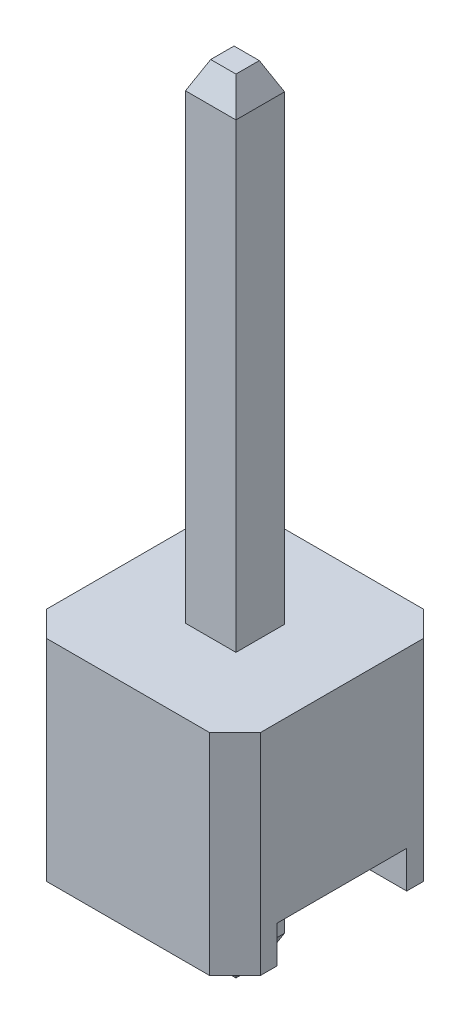
ISO-10303-21;
HEADER;
FILE_DESCRIPTION(('STEP AP214'),'2;1');
FILE_NAME('part.step','',(''),(''),'','','');
FILE_SCHEMA(('AUTOMOTIVE_DESIGN { 1 0 10303 214 1 1 1 1 }'));
ENDSEC;
DATA;
#1=APPLICATION_CONTEXT('core data for automotive mechanical design processes');
#2=APPLICATION_PROTOCOL_DEFINITION('international standard','automotive_design',2000,#1);
#3=PRODUCT_CONTEXT('',#1,'mechanical');
#4=PRODUCT('Part','Part','',(#3));
#5=PRODUCT_RELATED_PRODUCT_CATEGORY('part','',(#4));
#6=PRODUCT_DEFINITION_FORMATION('','',#4);
#7=PRODUCT_DEFINITION_CONTEXT('part definition',#1,'design');
#8=PRODUCT_DEFINITION('design','',#6,#7);
#9=PRODUCT_DEFINITION_SHAPE('','',#8);
#10=(LENGTH_UNIT() NAMED_UNIT(*) SI_UNIT(.MILLI.,.METRE.));
#11=(NAMED_UNIT(*) PLANE_ANGLE_UNIT() SI_UNIT($,.RADIAN.));
#12=(NAMED_UNIT(*) SI_UNIT($,.STERADIAN.) SOLID_ANGLE_UNIT());
#13=UNCERTAINTY_MEASURE_WITH_UNIT(LENGTH_MEASURE(1.E-05),#10,'distance_accuracy_value','');
#14=(GEOMETRIC_REPRESENTATION_CONTEXT(3) GLOBAL_UNCERTAINTY_ASSIGNED_CONTEXT((#13)) GLOBAL_UNIT_ASSIGNED_CONTEXT((#10,
#11,#12)) REPRESENTATION_CONTEXT('',''));
#15=CARTESIAN_POINT('',(0.,0.,0.));
#16=DIRECTION('',(0.,0.,1.));
#17=DIRECTION('',(1.,0.,0.));
#18=AXIS2_PLACEMENT_3D('',#15,#16,#17);
#19=CARTESIAN_POINT('',(15.6674969604626,-5.69124998633488,2.27287404611807));
#20=DIRECTION('',(0.,-1.,0.));
#21=DIRECTION('',(0.,0.,-1.));
#22=AXIS2_PLACEMENT_3D('',#19,#20,#21);
#23=PLANE('',#22);
#24=DIRECTION('',(1.,0.,0.));
#25=VECTOR('',#24,1.);
#26=CARTESIAN_POINT('',(15.0674969604626,-5.69124998633488,2.42287404611807));
#27=LINE('',#26,#25);
#28=CARTESIAN_POINT('',(15.2174969604626,-5.69124998633488,2.42287404611807));
#29=VERTEX_POINT('',#28);
#30=CARTESIAN_POINT('',(15.5174969604626,-5.69124998633488,2.42287404611807));
#31=VERTEX_POINT('',#30);
#32=EDGE_CURVE('E194',#29,#31,#27,.T.);
#33=ORIENTED_EDGE('',*,*,#32,.T.);
#34=DIRECTION('',(0.,0.,1.));
#35=VECTOR('',#34,1.);
#36=CARTESIAN_POINT('',(15.5174969604626,-5.69124998633488,2.27287404611807));
#37=LINE('',#36,#35);
#38=CARTESIAN_POINT('',(15.5174969604626,-5.69124998633488,2.70038017622598));
#39=VERTEX_POINT('',#38);
#40=EDGE_CURVE('E179',#31,#39,#37,.T.);
#41=ORIENTED_EDGE('',*,*,#40,.T.);
#42=DIRECTION('',(1.,0.,0.));
#43=VECTOR('',#42,1.);
#44=CARTESIAN_POINT('',(15.6674969604626,-5.69124998633488,2.70038017622598));
#45=LINE('',#44,#43);
#46=CARTESIAN_POINT('',(15.2174969604626,-5.69124998633488,2.70038017622598));
#47=VERTEX_POINT('',#46);
#48=EDGE_CURVE('E20',#39,#47,#45,.F.);
#49=ORIENTED_EDGE('',*,*,#48,.T.);
#50=DIRECTION('',(0.,0.,1.));
#51=VECTOR('',#50,1.);
#52=CARTESIAN_POINT('',(15.2174969604626,-5.69124998633488,2.85038017622598));
#53=LINE('',#52,#51);
#54=EDGE_CURVE('E174',#47,#29,#53,.F.);
#55=ORIENTED_EDGE('',*,*,#54,.T.);
#56=EDGE_LOOP('',(#33,#41,#49,#55));
#57=FACE_BOUND('',#56,.T.);
#58=ADVANCED_FACE('F17',(#57),#23,.T.);
#59=CARTESIAN_POINT('',(15.6674969604626,-5.36957394825845,2.85038017622598));
#60=DIRECTION('',(0.,0.4226182617407,-0.90630778703665));
#61=DIRECTION('',(0.,0.90630778703665,0.4226182617407));
#62=AXIS2_PLACEMENT_3D('',#59,#60,#61);
#63=PLANE('',#62);
#64=DIRECTION('',(1.,0.,0.));
#65=VECTOR('',#64,1.);
#66=CARTESIAN_POINT('',(15.6674969604626,-5.36957394825845,2.85038017622598));
#67=LINE('',#66,#65);
#68=CARTESIAN_POINT('',(15.0674969604626,-5.36957394825845,2.85038017622598));
#69=VERTEX_POINT('',#68);
#70=CARTESIAN_POINT('',(15.6674969604626,-5.36957394825845,2.85038017622598));
#71=VERTEX_POINT('',#70);
#72=EDGE_CURVE('E186',#69,#71,#67,.T.);
#73=ORIENTED_EDGE('',*,*,#72,.F.);
#74=DIRECTION('',(0.389281620635028,-0.834817129478987,-0.389281620635024));
#75=VECTOR('',#74,1.);
#76=CARTESIAN_POINT('',(15.0674969604626,-5.36957394825845,2.85038017622598));
#77=LINE('',#76,#75);
#78=EDGE_CURVE('E182',#69,#47,#77,.T.);
#79=ORIENTED_EDGE('',*,*,#78,.T.);
#80=ORIENTED_EDGE('',*,*,#48,.F.);
#81=DIRECTION('',(0.389281620635027,0.834817129478987,0.389281620635025));
#82=VECTOR('',#81,1.);
#83=CARTESIAN_POINT('',(15.5174969604626,-5.69124998633488,2.70038017622598));
#84=LINE('',#83,#82);
#85=EDGE_CURVE('E202',#39,#71,#84,.T.);
#86=ORIENTED_EDGE('',*,*,#85,.T.);
#87=EDGE_LOOP('',(#73,#79,#80,#86));
#88=FACE_BOUND('',#87,.T.);
#89=ADVANCED_FACE('F184',(#88),#63,.F.);
#90=CARTESIAN_POINT('',(15.0674969604626,-5.36957394825845,2.85038017622598));
#91=DIRECTION('',(0.906307787036649,0.422618261740701,0.));
#92=DIRECTION('',(-0.422618261740701,0.906307787036649,0.));
#93=AXIS2_PLACEMENT_3D('',#90,#91,#92);
#94=PLANE('',#93);
#95=ORIENTED_EDGE('',*,*,#54,.F.);
#96=ORIENTED_EDGE('',*,*,#78,.F.);
#97=DIRECTION('',(0.,0.,1.));
#98=VECTOR('',#97,1.);
#99=CARTESIAN_POINT('',(15.0674969604626,-5.36957394825845,2.85038017622598));
#100=LINE('',#99,#98);
#101=CARTESIAN_POINT('',(15.0674969604626,-5.36957394825845,2.27287404611807));
#102=VERTEX_POINT('',#101);
#103=EDGE_CURVE('E205',#102,#69,#100,.T.);
#104=ORIENTED_EDGE('',*,*,#103,.F.);
#105=DIRECTION('',(0.389281620635023,-0.834817129478988,0.389281620635027));
#106=VECTOR('',#105,1.);
#107=CARTESIAN_POINT('',(15.0674969604626,-5.36957394825845,2.27287404611807));
#108=LINE('',#107,#106);
#109=EDGE_CURVE('E191',#102,#29,#108,.T.);
#110=ORIENTED_EDGE('',*,*,#109,.T.);
#111=EDGE_LOOP('',(#95,#96,#104,#110));
#112=FACE_BOUND('',#111,.T.);
#113=ADVANCED_FACE('F189',(#112),#94,.F.);
#114=CARTESIAN_POINT('',(15.0674969604626,-5.36957394825845,2.27287404611807));
#115=DIRECTION('',(0.,0.422618261740701,0.906307787036649));
#116=DIRECTION('',(0.,-0.906307787036649,0.422618261740701));
#117=AXIS2_PLACEMENT_3D('',#114,#115,#116);
#118=PLANE('',#117);
#119=ORIENTED_EDGE('',*,*,#32,.F.);
#120=ORIENTED_EDGE('',*,*,#109,.F.);
#121=DIRECTION('',(-1.,0.,0.));
#122=VECTOR('',#121,1.);
#123=CARTESIAN_POINT('',(15.0674969604626,-5.36957394825845,2.27287404611807));
#124=LINE('',#123,#122);
#125=CARTESIAN_POINT('',(15.6674969604626,-5.36957394825845,2.27287404611807));
#126=VERTEX_POINT('',#125);
#127=EDGE_CURVE('E211',#126,#102,#124,.T.);
#128=ORIENTED_EDGE('',*,*,#127,.F.);
#129=DIRECTION('',(-0.389281620635028,-0.834817129478988,0.389281620635023));
#130=VECTOR('',#129,1.);
#131=CARTESIAN_POINT('',(15.6674969604626,-5.36957394825845,2.27287404611807));
#132=LINE('',#131,#130);
#133=EDGE_CURVE('E198',#126,#31,#132,.T.);
#134=ORIENTED_EDGE('',*,*,#133,.T.);
#135=EDGE_LOOP('',(#119,#120,#128,#134));
#136=FACE_BOUND('',#135,.T.);
#137=ADVANCED_FACE('F518',(#136),#118,.F.);
#138=CARTESIAN_POINT('',(15.6674969604626,-5.36957394825845,2.27287404611807));
#139=DIRECTION('',(-0.906307787036649,0.422618261740701,0.));
#140=DIRECTION('',(-0.422618261740701,-0.906307787036649,0.));
#141=AXIS2_PLACEMENT_3D('',#138,#139,#140);
#142=PLANE('',#141);
#143=ORIENTED_EDGE('',*,*,#40,.F.);
#144=ORIENTED_EDGE('',*,*,#133,.F.);
#145=DIRECTION('',(0.,0.,-1.));
#146=VECTOR('',#145,1.);
#147=CARTESIAN_POINT('',(15.6674969604626,-5.36957394825845,2.27287404611807));
#148=LINE('',#147,#146);
#149=EDGE_CURVE('E220',#71,#126,#148,.T.);
#150=ORIENTED_EDGE('',*,*,#149,.F.);
#151=ORIENTED_EDGE('',*,*,#85,.F.);
#152=EDGE_LOOP('',(#143,#144,#150,#151));
#153=FACE_BOUND('',#152,.T.);
#154=ADVANCED_FACE('F514',(#153),#142,.F.);
#155=CARTESIAN_POINT('',(15.6674969604626,-5.69124998633488,2.85038017622598));
#156=DIRECTION('',(0.,0.,1.));
#157=DIRECTION('',(1.,0.,0.));
#158=AXIS2_PLACEMENT_3D('',#155,#156,#157);
#159=PLANE('',#158);
#160=DIRECTION('',(0.,1.,0.));
#161=VECTOR('',#160,1.);
#162=CARTESIAN_POINT('',(15.6674969604626,-5.69124998633488,2.85038017622598));
#163=LINE('',#162,#161);
#164=CARTESIAN_POINT('',(15.6674969604626,-4.25124998633488,2.85038017622598));
#165=VERTEX_POINT('',#164);
#166=EDGE_CURVE('E217',#165,#71,#163,.F.);
#167=ORIENTED_EDGE('',*,*,#166,.F.);
#168=DIRECTION('',(1.,0.,0.));
#169=VECTOR('',#168,1.);
#170=CARTESIAN_POINT('',(14.0974969604626,-4.25124998633488,2.85038017622598));
#171=LINE('',#170,#169);
#172=CARTESIAN_POINT('',(15.0674969604626,-4.25124998633488,2.85038017622598));
#173=VERTEX_POINT('',#172);
#174=EDGE_CURVE('E230',#165,#173,#171,.F.);
#175=ORIENTED_EDGE('',*,*,#174,.T.);
#176=DIRECTION('',(0.,1.,0.));
#177=VECTOR('',#176,1.);
#178=CARTESIAN_POINT('',(15.0674969604626,-5.69124998633488,2.85038017622598));
#179=LINE('',#178,#177);
#180=EDGE_CURVE('E208',#69,#173,#179,.T.);
#181=ORIENTED_EDGE('',*,*,#180,.F.);
#182=ORIENTED_EDGE('',*,*,#72,.T.);
#183=EDGE_LOOP('',(#167,#175,#181,#182));
#184=FACE_BOUND('',#183,.T.);
#185=ADVANCED_FACE('F510',(#184),#159,.T.);
#186=CARTESIAN_POINT('',(15.0674969604626,-5.69124998633488,2.85038017622598));
#187=DIRECTION('',(-1.,0.,0.));
#188=DIRECTION('',(0.,0.,1.));
#189=AXIS2_PLACEMENT_3D('',#186,#187,#188);
#190=PLANE('',#189);
#191=ORIENTED_EDGE('',*,*,#180,.T.);
#192=DIRECTION('',(0.,0.,1.));
#193=VECTOR('',#192,1.);
#194=CARTESIAN_POINT('',(15.0674969604626,-4.25124998633488,3.33162711117202));
#195=LINE('',#194,#193);
#196=CARTESIAN_POINT('',(15.0674969604626,-4.25124998633488,2.27287404611807));
#197=VERTEX_POINT('',#196);
#198=EDGE_CURVE('E232',#173,#197,#195,.F.);
#199=ORIENTED_EDGE('',*,*,#198,.T.);
#200=DIRECTION('',(0.,1.,0.));
#201=VECTOR('',#200,1.);
#202=CARTESIAN_POINT('',(15.0674969604626,-5.69124998633488,2.27287404611807));
#203=LINE('',#202,#201);
#204=EDGE_CURVE('E214',#102,#197,#203,.T.);
#205=ORIENTED_EDGE('',*,*,#204,.F.);
#206=ORIENTED_EDGE('',*,*,#103,.T.);
#207=EDGE_LOOP('',(#191,#199,#205,#206));
#208=FACE_BOUND('',#207,.T.);
#209=ADVANCED_FACE('F506',(#208),#190,.T.);
#210=CARTESIAN_POINT('',(15.0674969604626,-5.69124998633488,2.27287404611807));
#211=DIRECTION('',(0.,0.,-1.));
#212=DIRECTION('',(-1.,0.,0.));
#213=AXIS2_PLACEMENT_3D('',#210,#211,#212);
#214=PLANE('',#213);
#215=ORIENTED_EDGE('',*,*,#204,.T.);
#216=DIRECTION('',(1.,0.,0.));
#217=VECTOR('',#216,1.);
#218=CARTESIAN_POINT('',(14.0974969604626,-4.25124998633488,2.27287404611807));
#219=LINE('',#218,#217);
#220=CARTESIAN_POINT('',(15.6674969604626,-4.25124998633488,2.27287404611807));
#221=VERTEX_POINT('',#220);
#222=EDGE_CURVE('E234',#197,#221,#219,.T.);
#223=ORIENTED_EDGE('',*,*,#222,.T.);
#224=DIRECTION('',(0.,1.,0.));
#225=VECTOR('',#224,1.);
#226=CARTESIAN_POINT('',(15.6674969604626,-5.69124998633488,2.27287404611807));
#227=LINE('',#226,#225);
#228=EDGE_CURVE('E223',#126,#221,#227,.T.);
#229=ORIENTED_EDGE('',*,*,#228,.F.);
#230=ORIENTED_EDGE('',*,*,#127,.T.);
#231=EDGE_LOOP('',(#215,#223,#229,#230));
#232=FACE_BOUND('',#231,.T.);
#233=ADVANCED_FACE('F502',(#232),#214,.T.);
#234=CARTESIAN_POINT('',(15.6674969604626,-5.69124998633488,2.27287404611807));
#235=DIRECTION('',(1.,0.,0.));
#236=DIRECTION('',(0.,0.,-1.));
#237=AXIS2_PLACEMENT_3D('',#234,#235,#236);
#238=PLANE('',#237);
#239=ORIENTED_EDGE('',*,*,#228,.T.);
#240=DIRECTION('',(0.,0.,1.));
#241=VECTOR('',#240,1.);
#242=CARTESIAN_POINT('',(15.6674969604626,-4.25124998633488,3.33162711117202));
#243=LINE('',#242,#241);
#244=EDGE_CURVE('E236',#221,#165,#243,.T.);
#245=ORIENTED_EDGE('',*,*,#244,.T.);
#246=ORIENTED_EDGE('',*,*,#166,.T.);
#247=ORIENTED_EDGE('',*,*,#149,.T.);
#248=EDGE_LOOP('',(#239,#245,#246,#247));
#249=FACE_BOUND('',#248,.T.);
#250=ADVANCED_FACE('F498',(#249),#238,.T.);
#251=CARTESIAN_POINT('',(14.0974969604626,-4.25124998633488,3.33162711117202));
#252=DIRECTION('',(0.,1.,0.));
#253=DIRECTION('',(0.,0.,1.));
#254=AXIS2_PLACEMENT_3D('',#251,#252,#253);
#255=PLANE('',#254);
#256=ORIENTED_EDGE('',*,*,#222,.F.);
#257=ORIENTED_EDGE('',*,*,#198,.F.);
#258=ORIENTED_EDGE('',*,*,#174,.F.);
#259=ORIENTED_EDGE('',*,*,#244,.F.);
#260=EDGE_LOOP('',(#256,#257,#258,#259));
#261=FACE_BOUND('',#260,.T.);
#262=DIRECTION('',(-1.,0.,0.));
#263=VECTOR('',#262,1.);
#264=CARTESIAN_POINT('',(14.0974969604626,-4.25124998633488,1.79162711117202));
#265=LINE('',#264,#263);
#266=CARTESIAN_POINT('',(14.0974969604626,-4.25124998633488,1.79162711117202));
#267=VERTEX_POINT('',#266);
#268=CARTESIAN_POINT('',(16.6374969604626,-4.25124998633488,1.79162711117202));
#269=VERTEX_POINT('',#268);
#270=EDGE_CURVE('E241',#267,#269,#265,.F.);
#271=ORIENTED_EDGE('',*,*,#270,.T.);
#272=DIRECTION('',(0.,0.,1.));
#273=VECTOR('',#272,1.);
#274=CARTESIAN_POINT('',(16.6374969604626,-4.25124998633488,3.33162711117202));
#275=LINE('',#274,#273);
#276=CARTESIAN_POINT('',(16.6374969604626,-4.25124998633488,3.33162711117202));
#277=VERTEX_POINT('',#276);
#278=EDGE_CURVE('E226',#277,#269,#275,.F.);
#279=ORIENTED_EDGE('',*,*,#278,.F.);
#280=DIRECTION('',(1.,0.,0.));
#281=VECTOR('',#280,1.);
#282=CARTESIAN_POINT('',(14.0974969604626,-4.25124998633488,3.33162711117202));
#283=LINE('',#282,#281);
#284=CARTESIAN_POINT('',(14.0974969604626,-4.25124998633488,3.33162711117202));
#285=VERTEX_POINT('',#284);
#286=EDGE_CURVE('E248',#277,#285,#283,.F.);
#287=ORIENTED_EDGE('',*,*,#286,.T.);
#288=DIRECTION('',(0.,0.,1.));
#289=VECTOR('',#288,1.);
#290=CARTESIAN_POINT('',(14.0974969604626,-4.25124998633488,3.33162711117202));
#291=LINE('',#290,#289);
#292=EDGE_CURVE('E228',#267,#285,#291,.T.);
#293=ORIENTED_EDGE('',*,*,#292,.F.);
#294=EDGE_LOOP('',(#271,#279,#287,#293));
#295=FACE_BOUND('',#294,.T.);
#296=ADVANCED_FACE('F495',(#261,#295),#255,.F.);
#297=CARTESIAN_POINT('',(15.5174969604626,3.60875001366512,2.27287404611807));
#298=DIRECTION('',(0.906307787036651,0.422618261740697,0.));
#299=DIRECTION('',(-0.422618261740697,0.906307787036651,0.));
#300=AXIS2_PLACEMENT_3D('',#297,#298,#299);
#301=PLANE('',#300);
#302=DIRECTION('',(0.389281620635025,-0.834817129478989,-0.389281620635023));
#303=VECTOR('',#302,1.);
#304=CARTESIAN_POINT('',(15.5174969604626,3.60875001366512,2.42287404611807));
#305=LINE('',#304,#303);
#306=CARTESIAN_POINT('',(15.5174969604626,3.60875001366512,2.42287404611807));
#307=VERTEX_POINT('',#306);
#308=CARTESIAN_POINT('',(15.6674969604626,3.28707397558869,2.27287404611807));
#309=VERTEX_POINT('',#308);
#310=EDGE_CURVE('E263',#307,#309,#305,.T.);
#311=ORIENTED_EDGE('',*,*,#310,.F.);
#312=DIRECTION('',(0.,0.,-1.));
#313=VECTOR('',#312,1.);
#314=CARTESIAN_POINT('',(15.5174969604626,3.60875001366512,2.27287404611807));
#315=LINE('',#314,#313);
#316=CARTESIAN_POINT('',(15.5174969604626,3.60875001366512,2.70038017622598));
#317=VERTEX_POINT('',#316);
#318=EDGE_CURVE('E256',#307,#317,#315,.F.);
#319=ORIENTED_EDGE('',*,*,#318,.T.);
#320=DIRECTION('',(-0.389281620635021,0.834817129478991,-0.389281620635023));
#321=VECTOR('',#320,1.);
#322=CARTESIAN_POINT('',(15.6674969604626,3.28707397558869,2.85038017622598));
#323=LINE('',#322,#321);
#324=CARTESIAN_POINT('',(15.6674969604626,3.28707397558869,2.85038017622598));
#325=VERTEX_POINT('',#324);
#326=EDGE_CURVE('E253',#325,#317,#323,.T.);
#327=ORIENTED_EDGE('',*,*,#326,.F.);
#328=DIRECTION('',(0.,0.,-1.));
#329=VECTOR('',#328,1.);
#330=CARTESIAN_POINT('',(15.6674969604626,3.28707397558869,2.27287404611807));
#331=LINE('',#330,#329);
#332=EDGE_CURVE('E266',#309,#325,#331,.F.);
#333=ORIENTED_EDGE('',*,*,#332,.F.);
#334=EDGE_LOOP('',(#311,#319,#327,#333));
#335=FACE_BOUND('',#334,.T.);
#336=ADVANCED_FACE('F472',(#335),#301,.T.);
#337=CARTESIAN_POINT('',(14.0974969604626,-4.25124998633488,1.79162711117202));
#338=DIRECTION('',(0.,0.,-1.));
#339=DIRECTION('',(-1.,0.,0.));
#340=AXIS2_PLACEMENT_3D('',#337,#338,#339);
#341=PLANE('',#340);
#342=DIRECTION('',(0.,1.,0.));
#343=VECTOR('',#342,1.);
#344=CARTESIAN_POINT('',(16.6374969604626,-4.25124998633488,1.79162711117202));
#345=LINE('',#344,#343);
#346=CARTESIAN_POINT('',(16.6374969604626,-4.69124998633488,1.79162711117202));
#347=VERTEX_POINT('',#346);
#348=EDGE_CURVE('E244',#269,#347,#345,.F.);
#349=ORIENTED_EDGE('',*,*,#348,.F.);
#350=ORIENTED_EDGE('',*,*,#270,.F.);
#351=DIRECTION('',(0.,1.,0.));
#352=VECTOR('',#351,1.);
#353=CARTESIAN_POINT('',(14.0974969604626,-4.25124998633488,1.79162711117202));
#354=LINE('',#353,#352);
#355=CARTESIAN_POINT('',(14.0974969604626,-4.69124998633488,1.79162711117202));
#356=VERTEX_POINT('',#355);
#357=EDGE_CURVE('E239',#356,#267,#354,.T.);
#358=ORIENTED_EDGE('',*,*,#357,.F.);
#359=DIRECTION('',(1.,0.,0.));
#360=VECTOR('',#359,1.);
#361=CARTESIAN_POINT('',(15.3674969604626,-4.69124998633488,1.79162711117202));
#362=LINE('',#361,#360);
#363=EDGE_CURVE('E273',#356,#347,#362,.T.);
#364=ORIENTED_EDGE('',*,*,#363,.T.);
#365=EDGE_LOOP('',(#349,#350,#358,#364));
#366=FACE_BOUND('',#365,.T.);
#367=ADVANCED_FACE('F488',(#366),#341,.F.);
#368=CARTESIAN_POINT('',(14.0974969604626,-4.25124998633488,3.33162711117202));
#369=DIRECTION('',(0.,0.,1.));
#370=DIRECTION('',(1.,0.,0.));
#371=AXIS2_PLACEMENT_3D('',#368,#369,#370);
#372=PLANE('',#371);
#373=DIRECTION('',(0.,1.,0.));
#374=VECTOR('',#373,1.);
#375=CARTESIAN_POINT('',(14.0974969604626,-4.25124998633488,3.33162711117202));
#376=LINE('',#375,#374);
#377=CARTESIAN_POINT('',(14.0974969604626,-4.69124998633488,3.33162711117202));
#378=VERTEX_POINT('',#377);
#379=EDGE_CURVE('E251',#285,#378,#376,.F.);
#380=ORIENTED_EDGE('',*,*,#379,.F.);
#381=ORIENTED_EDGE('',*,*,#286,.F.);
#382=DIRECTION('',(0.,1.,0.));
#383=VECTOR('',#382,1.);
#384=CARTESIAN_POINT('',(16.6374969604626,-4.25124998633488,3.33162711117202));
#385=LINE('',#384,#383);
#386=CARTESIAN_POINT('',(16.6374969604626,-4.69124998633488,3.33162711117202));
#387=VERTEX_POINT('',#386);
#388=EDGE_CURVE('E246',#387,#277,#385,.T.);
#389=ORIENTED_EDGE('',*,*,#388,.F.);
#390=DIRECTION('',(1.,0.,0.));
#391=VECTOR('',#390,1.);
#392=CARTESIAN_POINT('',(15.3674969604626,-4.69124998633488,3.33162711117202));
#393=LINE('',#392,#391);
#394=EDGE_CURVE('E288',#387,#378,#393,.F.);
#395=ORIENTED_EDGE('',*,*,#394,.T.);
#396=EDGE_LOOP('',(#380,#381,#389,#395));
#397=FACE_BOUND('',#396,.T.);
#398=ADVANCED_FACE('F482',(#397),#372,.F.);
#399=CARTESIAN_POINT('',(15.6674969604626,3.60875001366512,2.70038017622598));
#400=DIRECTION('',(0.,0.422618261740697,0.906307787036651));
#401=DIRECTION('',(0.,-0.906307787036651,0.422618261740697));
#402=AXIS2_PLACEMENT_3D('',#399,#400,#401);
#403=PLANE('',#402);
#404=ORIENTED_EDGE('',*,*,#326,.T.);
#405=DIRECTION('',(1.,0.,0.));
#406=VECTOR('',#405,1.);
#407=CARTESIAN_POINT('',(15.6674969604626,3.60875001366512,2.70038017622598));
#408=LINE('',#407,#406);
#409=CARTESIAN_POINT('',(15.2174969604626,3.60875001366512,2.70038017622598));
#410=VERTEX_POINT('',#409);
#411=EDGE_CURVE('E258',#317,#410,#408,.F.);
#412=ORIENTED_EDGE('',*,*,#411,.T.);
#413=DIRECTION('',(0.389281620635025,0.83481712947899,-0.38928162063502));
#414=VECTOR('',#413,1.);
#415=CARTESIAN_POINT('',(15.0674969604626,3.28707397558869,2.85038017622598));
#416=LINE('',#415,#414);
#417=CARTESIAN_POINT('',(15.0674969604626,3.28707397558869,2.85038017622598));
#418=VERTEX_POINT('',#417);
#419=EDGE_CURVE('E310',#418,#410,#416,.T.);
#420=ORIENTED_EDGE('',*,*,#419,.F.);
#421=DIRECTION('',(1.,0.,0.));
#422=VECTOR('',#421,1.);
#423=CARTESIAN_POINT('',(15.6674969604626,3.28707397558869,2.85038017622598));
#424=LINE('',#423,#422);
#425=EDGE_CURVE('E303',#325,#418,#424,.F.);
#426=ORIENTED_EDGE('',*,*,#425,.F.);
#427=EDGE_LOOP('',(#404,#412,#420,#426));
#428=FACE_BOUND('',#427,.T.);
#429=ADVANCED_FACE('F466',(#428),#403,.T.);
#430=CARTESIAN_POINT('',(15.6674969604626,3.60875001366512,2.27287404611807));
#431=DIRECTION('',(0.,-1.,0.));
#432=DIRECTION('',(0.,0.,-1.));
#433=AXIS2_PLACEMENT_3D('',#430,#431,#432);
#434=PLANE('',#433);
#435=ORIENTED_EDGE('',*,*,#318,.F.);
#436=DIRECTION('',(1.,0.,0.));
#437=VECTOR('',#436,1.);
#438=CARTESIAN_POINT('',(15.6674969604626,3.60875001366512,2.42287404611807));
#439=LINE('',#438,#437);
#440=CARTESIAN_POINT('',(15.2174969604626,3.60875001366512,2.42287404611807));
#441=VERTEX_POINT('',#440);
#442=EDGE_CURVE('E260',#441,#307,#439,.T.);
#443=ORIENTED_EDGE('',*,*,#442,.F.);
#444=DIRECTION('',(0.,0.,1.));
#445=VECTOR('',#444,1.);
#446=CARTESIAN_POINT('',(15.2174969604626,3.60875001366512,2.27287404611807));
#447=LINE('',#446,#445);
#448=EDGE_CURVE('E313',#410,#441,#447,.F.);
#449=ORIENTED_EDGE('',*,*,#448,.F.);
#450=ORIENTED_EDGE('',*,*,#411,.F.);
#451=EDGE_LOOP('',(#435,#443,#449,#450));
#452=FACE_BOUND('',#451,.T.);
#453=ADVANCED_FACE('F474',(#452),#434,.F.);
#454=CARTESIAN_POINT('',(15.6674969604626,3.60875001366512,2.42287404611807));
#455=DIRECTION('',(0.,0.422618261740697,-0.906307787036651));
#456=DIRECTION('',(0.,0.906307787036651,0.422618261740697));
#457=AXIS2_PLACEMENT_3D('',#454,#455,#456);
#458=PLANE('',#457);
#459=ORIENTED_EDGE('',*,*,#310,.T.);
#460=DIRECTION('',(-1.,0.,0.));
#461=VECTOR('',#460,1.);
#462=CARTESIAN_POINT('',(15.0674969604626,3.28707397558869,2.27287404611807));
#463=LINE('',#462,#461);
#464=CARTESIAN_POINT('',(15.0674969604626,3.28707397558869,2.27287404611807));
#465=VERTEX_POINT('',#464);
#466=EDGE_CURVE('E316',#465,#309,#463,.F.);
#467=ORIENTED_EDGE('',*,*,#466,.F.);
#468=DIRECTION('',(-0.389281620635025,-0.834817129478989,-0.389281620635022));
#469=VECTOR('',#468,1.);
#470=CARTESIAN_POINT('',(15.2174969604626,3.60875001366512,2.42287404611807));
#471=LINE('',#470,#469);
#472=EDGE_CURVE('E307',#441,#465,#471,.T.);
#473=ORIENTED_EDGE('',*,*,#472,.F.);
#474=ORIENTED_EDGE('',*,*,#442,.T.);
#475=EDGE_LOOP('',(#459,#467,#473,#474));
#476=FACE_BOUND('',#475,.T.);
#477=ADVANCED_FACE('F471',(#476),#458,.T.);
#478=CARTESIAN_POINT('',(15.6674969604626,-5.69124998633488,2.27287404611807));
#479=DIRECTION('',(1.,0.,0.));
#480=DIRECTION('',(0.,0.,-1.));
#481=AXIS2_PLACEMENT_3D('',#478,#479,#480);
#482=PLANE('',#481);
#483=DIRECTION('',(0.,1.,0.));
#484=VECTOR('',#483,1.);
#485=CARTESIAN_POINT('',(15.6674969604626,-5.69124998633488,2.85038017622598));
#486=LINE('',#485,#484);
#487=CARTESIAN_POINT('',(15.6674969604626,-2.19124998633488,2.85038017622598));
#488=VERTEX_POINT('',#487);
#489=EDGE_CURVE('E300',#488,#325,#486,.T.);
#490=ORIENTED_EDGE('',*,*,#489,.F.);
#491=DIRECTION('',(0.,0.,-1.));
#492=VECTOR('',#491,1.);
#493=CARTESIAN_POINT('',(15.6674969604626,-2.19124998633488,2.27287404611807));
#494=LINE('',#493,#492);
#495=CARTESIAN_POINT('',(15.6674969604626,-2.19124998633488,2.27287404611807));
#496=VERTEX_POINT('',#495);
#497=EDGE_CURVE('E269',#488,#496,#494,.T.);
#498=ORIENTED_EDGE('',*,*,#497,.T.);
#499=DIRECTION('',(0.,1.,0.));
#500=VECTOR('',#499,1.);
#501=CARTESIAN_POINT('',(15.6674969604626,-5.69124998633488,2.27287404611807));
#502=LINE('',#501,#500);
#503=EDGE_CURVE('E319',#309,#496,#502,.F.);
#504=ORIENTED_EDGE('',*,*,#503,.F.);
#505=ORIENTED_EDGE('',*,*,#332,.T.);
#506=EDGE_LOOP('',(#490,#498,#504,#505));
#507=FACE_BOUND('',#506,.T.);
#508=ADVANCED_FACE('F462',(#507),#482,.T.);
#509=CARTESIAN_POINT('',(15.3674969604626,-4.69124998633488,0.321627111172016));
#510=DIRECTION('',(0.,1.,0.));
#511=DIRECTION('',(0.,0.,1.));
#512=AXIS2_PLACEMENT_3D('',#509,#510,#511);
#513=PLANE('',#512);
#514=ORIENTED_EDGE('',*,*,#363,.F.);
#515=DIRECTION('',(0.,0.,1.));
#516=VECTOR('',#515,1.);
#517=CARTESIAN_POINT('',(14.0974969604626,-4.69124998633488,0.321627111172016));
#518=LINE('',#517,#516);
#519=CARTESIAN_POINT('',(14.0974969604626,-4.69124998633488,1.59162711117202));
#520=VERTEX_POINT('',#519);
#521=EDGE_CURVE('E271',#520,#356,#518,.T.);
#522=ORIENTED_EDGE('',*,*,#521,.F.);
#523=DIRECTION('',(0.707106781186547,0.,-0.707106781186548));
#524=VECTOR('',#523,1.);
#525=CARTESIAN_POINT('',(14.3974969604626,-4.69124998633488,1.29162711117202));
#526=LINE('',#525,#524);
#527=CARTESIAN_POINT('',(14.3974969604626,-4.69124998633488,1.29162711117202));
#528=VERTEX_POINT('',#527);
#529=EDGE_CURVE('E280',#520,#528,#526,.T.);
#530=ORIENTED_EDGE('',*,*,#529,.T.);
#531=DIRECTION('',(1.,0.,0.));
#532=VECTOR('',#531,1.);
#533=CARTESIAN_POINT('',(16.3374969604626,-4.69124998633488,1.29162711117202));
#534=LINE('',#533,#532);
#535=CARTESIAN_POINT('',(16.3374969604626,-4.69124998633488,1.29162711117202));
#536=VERTEX_POINT('',#535);
#537=EDGE_CURVE('E330',#528,#536,#534,.T.);
#538=ORIENTED_EDGE('',*,*,#537,.T.);
#539=DIRECTION('',(0.707106781186546,0.,0.707106781186549));
#540=VECTOR('',#539,1.);
#541=CARTESIAN_POINT('',(16.6374969604626,-4.69124998633488,1.59162711117202));
#542=LINE('',#541,#540);
#543=CARTESIAN_POINT('',(16.6374969604626,-4.69124998633488,1.59162711117202));
#544=VERTEX_POINT('',#543);
#545=EDGE_CURVE('E297',#536,#544,#542,.T.);
#546=ORIENTED_EDGE('',*,*,#545,.T.);
#547=DIRECTION('',(0.,0.,1.));
#548=VECTOR('',#547,1.);
#549=CARTESIAN_POINT('',(16.6374969604626,-4.69124998633488,0.321627111172016));
#550=LINE('',#549,#548);
#551=EDGE_CURVE('E276',#347,#544,#550,.F.);
#552=ORIENTED_EDGE('',*,*,#551,.F.);
#553=EDGE_LOOP('',(#514,#522,#530,#538,#546,#552));
#554=FACE_BOUND('',#553,.T.);
#555=ADVANCED_FACE('F630',(#554),#513,.F.);
#556=CARTESIAN_POINT('',(14.3974969604626,-2.19124998633488,1.29162711117202));
#557=DIRECTION('',(0.707106781186548,0.,0.707106781186547));
#558=DIRECTION('',(0.707106781186547,0.,-0.707106781186548));
#559=AXIS2_PLACEMENT_3D('',#556,#557,#558);
#560=PLANE('',#559);
#561=DIRECTION('',(0.,1.,0.));
#562=VECTOR('',#561,1.);
#563=CARTESIAN_POINT('',(14.0974969604626,-2.19124998633488,1.59162711117202));
#564=LINE('',#563,#562);
#565=CARTESIAN_POINT('',(14.0974969604626,-2.19124998633488,1.59162711117202));
#566=VERTEX_POINT('',#565);
#567=EDGE_CURVE('E333',#520,#566,#564,.T.);
#568=ORIENTED_EDGE('',*,*,#567,.T.);
#569=DIRECTION('',(0.707106781186547,0.,-0.707106781186548));
#570=VECTOR('',#569,1.);
#571=CARTESIAN_POINT('',(14.3974969604626,-2.19124998633488,1.29162711117202));
#572=LINE('',#571,#570);
#573=CARTESIAN_POINT('',(14.3974969604626,-2.19124998633488,1.29162711117202));
#574=VERTEX_POINT('',#573);
#575=EDGE_CURVE('E278',#574,#566,#572,.F.);
#576=ORIENTED_EDGE('',*,*,#575,.F.);
#577=DIRECTION('',(0.,1.,0.));
#578=VECTOR('',#577,1.);
#579=CARTESIAN_POINT('',(14.3974969604626,-2.19124998633488,1.29162711117202));
#580=LINE('',#579,#578);
#581=EDGE_CURVE('E327',#574,#528,#580,.F.);
#582=ORIENTED_EDGE('',*,*,#581,.T.);
#583=ORIENTED_EDGE('',*,*,#529,.F.);
#584=EDGE_LOOP('',(#568,#576,#582,#583));
#585=FACE_BOUND('',#584,.T.);
#586=ADVANCED_FACE('F395',(#585),#560,.F.);
#587=CARTESIAN_POINT('',(14.0974969604626,-2.19124998633488,3.53162711117202));
#588=DIRECTION('',(0.707106781186547,0.,-0.707106781186548));
#589=DIRECTION('',(-0.707106781186548,0.,-0.707106781186547));
#590=AXIS2_PLACEMENT_3D('',#587,#588,#589);
#591=PLANE('',#590);
#592=DIRECTION('',(0.,1.,0.));
#593=VECTOR('',#592,1.);
#594=CARTESIAN_POINT('',(14.3974969604626,-2.19124998633488,3.83162711117202));
#595=LINE('',#594,#593);
#596=CARTESIAN_POINT('',(14.3974969604626,-4.69124998633488,3.83162711117202));
#597=VERTEX_POINT('',#596);
#598=CARTESIAN_POINT('',(14.3974969604626,-2.19124998633488,3.83162711117202));
#599=VERTEX_POINT('',#598);
#600=EDGE_CURVE('E341',#597,#599,#595,.T.);
#601=ORIENTED_EDGE('',*,*,#600,.T.);
#602=DIRECTION('',(-0.707106781186548,0.,-0.707106781186547));
#603=VECTOR('',#602,1.);
#604=CARTESIAN_POINT('',(14.0974969604626,-2.19124998633488,3.53162711117202));
#605=LINE('',#604,#603);
#606=CARTESIAN_POINT('',(14.0974969604626,-2.19124998633488,3.53162711117202));
#607=VERTEX_POINT('',#606);
#608=EDGE_CURVE('E282',#607,#599,#605,.F.);
#609=ORIENTED_EDGE('',*,*,#608,.F.);
#610=DIRECTION('',(0.,1.,0.));
#611=VECTOR('',#610,1.);
#612=CARTESIAN_POINT('',(14.0974969604626,-2.19124998633488,3.53162711117202));
#613=LINE('',#612,#611);
#614=CARTESIAN_POINT('',(14.0974969604626,-4.69124998633488,3.53162711117202));
#615=VERTEX_POINT('',#614);
#616=EDGE_CURVE('E336',#607,#615,#613,.F.);
#617=ORIENTED_EDGE('',*,*,#616,.T.);
#618=DIRECTION('',(0.707106781186547,0.,0.707106781186548));
#619=VECTOR('',#618,1.);
#620=CARTESIAN_POINT('',(14.0974969604626,-4.69124998633488,3.53162711117202));
#621=LINE('',#620,#619);
#622=EDGE_CURVE('E284',#615,#597,#621,.T.);
#623=ORIENTED_EDGE('',*,*,#622,.T.);
#624=EDGE_LOOP('',(#601,#609,#617,#623));
#625=FACE_BOUND('',#624,.T.);
#626=ADVANCED_FACE('F402',(#625),#591,.F.);
#627=CARTESIAN_POINT('',(15.3674969604626,-4.69124998633488,0.321627111172016));
#628=DIRECTION('',(0.,1.,0.));
#629=DIRECTION('',(0.,0.,1.));
#630=AXIS2_PLACEMENT_3D('',#627,#628,#629);
#631=PLANE('',#630);
#632=ORIENTED_EDGE('',*,*,#394,.F.);
#633=DIRECTION('',(0.,0.,1.));
#634=VECTOR('',#633,1.);
#635=CARTESIAN_POINT('',(16.6374969604626,-4.69124998633488,0.321627111172016));
#636=LINE('',#635,#634);
#637=CARTESIAN_POINT('',(16.6374969604626,-4.69124998633488,3.53162711117202));
#638=VERTEX_POINT('',#637);
#639=EDGE_CURVE('E286',#638,#387,#636,.F.);
#640=ORIENTED_EDGE('',*,*,#639,.F.);
#641=DIRECTION('',(-0.707106781186549,0.,0.707106781186546));
#642=VECTOR('',#641,1.);
#643=CARTESIAN_POINT('',(16.3374969604626,-4.69124998633488,3.83162711117202));
#644=LINE('',#643,#642);
#645=CARTESIAN_POINT('',(16.3374969604626,-4.69124998633488,3.83162711117202));
#646=VERTEX_POINT('',#645);
#647=EDGE_CURVE('E293',#638,#646,#644,.T.);
#648=ORIENTED_EDGE('',*,*,#647,.T.);
#649=DIRECTION('',(-1.,0.,0.));
#650=VECTOR('',#649,1.);
#651=CARTESIAN_POINT('',(14.3974969604626,-4.69124998633488,3.83162711117202));
#652=LINE('',#651,#650);
#653=EDGE_CURVE('E347',#646,#597,#652,.T.);
#654=ORIENTED_EDGE('',*,*,#653,.T.);
#655=ORIENTED_EDGE('',*,*,#622,.F.);
#656=DIRECTION('',(0.,0.,-1.));
#657=VECTOR('',#656,1.);
#658=CARTESIAN_POINT('',(14.0974969604626,-4.69124998633488,1.59162711117202));
#659=LINE('',#658,#657);
#660=EDGE_CURVE('E338',#615,#378,#659,.T.);
#661=ORIENTED_EDGE('',*,*,#660,.T.);
#662=EDGE_LOOP('',(#632,#640,#648,#654,#655,#661));
#663=FACE_BOUND('',#662,.T.);
#664=ADVANCED_FACE('F405',(#663),#631,.F.);
#665=CARTESIAN_POINT('',(16.3374969604626,-2.19124998633488,3.83162711117202));
#666=DIRECTION('',(-0.707106781186546,0.,-0.707106781186549));
#667=DIRECTION('',(-0.707106781186549,0.,0.707106781186546));
#668=AXIS2_PLACEMENT_3D('',#665,#666,#667);
#669=PLANE('',#668);
#670=DIRECTION('',(0.,1.,0.));
#671=VECTOR('',#670,1.);
#672=CARTESIAN_POINT('',(16.6374969604626,-2.19124998633488,3.53162711117202));
#673=LINE('',#672,#671);
#674=CARTESIAN_POINT('',(16.6374969604626,-2.19124998633488,3.53162711117202));
#675=VERTEX_POINT('',#674);
#676=EDGE_CURVE('E350',#638,#675,#673,.T.);
#677=ORIENTED_EDGE('',*,*,#676,.T.);
#678=DIRECTION('',(-0.707106781186549,0.,0.707106781186546));
#679=VECTOR('',#678,1.);
#680=CARTESIAN_POINT('',(16.3374969604626,-2.19124998633488,3.83162711117202));
#681=LINE('',#680,#679);
#682=CARTESIAN_POINT('',(16.3374969604626,-2.19124998633488,3.83162711117202));
#683=VERTEX_POINT('',#682);
#684=EDGE_CURVE('E291',#683,#675,#681,.F.);
#685=ORIENTED_EDGE('',*,*,#684,.F.);
#686=DIRECTION('',(0.,1.,0.));
#687=VECTOR('',#686,1.);
#688=CARTESIAN_POINT('',(16.3374969604626,-2.19124998633488,3.83162711117202));
#689=LINE('',#688,#687);
#690=EDGE_CURVE('E344',#683,#646,#689,.F.);
#691=ORIENTED_EDGE('',*,*,#690,.T.);
#692=ORIENTED_EDGE('',*,*,#647,.F.);
#693=EDGE_LOOP('',(#677,#685,#691,#692));
#694=FACE_BOUND('',#693,.T.);
#695=ADVANCED_FACE('F414',(#694),#669,.F.);
#696=CARTESIAN_POINT('',(16.6374969604626,-2.19124998633488,1.59162711117202));
#697=DIRECTION('',(-0.707106781186549,0.,0.707106781186546));
#698=DIRECTION('',(0.707106781186546,0.,0.707106781186549));
#699=AXIS2_PLACEMENT_3D('',#696,#697,#698);
#700=PLANE('',#699);
#701=DIRECTION('',(0.,1.,0.));
#702=VECTOR('',#701,1.);
#703=CARTESIAN_POINT('',(16.3374969604626,-2.19124998633488,1.29162711117202));
#704=LINE('',#703,#702);
#705=CARTESIAN_POINT('',(16.3374969604626,-2.19124998633488,1.29162711117202));
#706=VERTEX_POINT('',#705);
#707=EDGE_CURVE('E324',#536,#706,#704,.T.);
#708=ORIENTED_EDGE('',*,*,#707,.T.);
#709=DIRECTION('',(0.707106781186546,0.,0.707106781186549));
#710=VECTOR('',#709,1.);
#711=CARTESIAN_POINT('',(16.6374969604626,-2.19124998633488,1.59162711117202));
#712=LINE('',#711,#710);
#713=CARTESIAN_POINT('',(16.6374969604626,-2.19124998633488,1.59162711117202));
#714=VERTEX_POINT('',#713);
#715=EDGE_CURVE('E295',#714,#706,#712,.F.);
#716=ORIENTED_EDGE('',*,*,#715,.F.);
#717=DIRECTION('',(0.,1.,0.));
#718=VECTOR('',#717,1.);
#719=CARTESIAN_POINT('',(16.6374969604626,-2.19124998633488,1.59162711117202));
#720=LINE('',#719,#718);
#721=EDGE_CURVE('E353',#714,#544,#720,.F.);
#722=ORIENTED_EDGE('',*,*,#721,.T.);
#723=ORIENTED_EDGE('',*,*,#545,.F.);
#724=EDGE_LOOP('',(#708,#716,#722,#723));
#725=FACE_BOUND('',#724,.T.);
#726=ADVANCED_FACE('F384',(#725),#700,.F.);
#727=CARTESIAN_POINT('',(15.6674969604626,-5.69124998633488,2.85038017622598));
#728=DIRECTION('',(0.,0.,1.));
#729=DIRECTION('',(1.,0.,0.));
#730=AXIS2_PLACEMENT_3D('',#727,#728,#729);
#731=PLANE('',#730);
#732=DIRECTION('',(0.,1.,0.));
#733=VECTOR('',#732,1.);
#734=CARTESIAN_POINT('',(15.0674969604626,-5.69124998633488,2.85038017622598));
#735=LINE('',#734,#733);
#736=CARTESIAN_POINT('',(15.0674969604626,-2.19124998633488,2.85038017622598));
#737=VERTEX_POINT('',#736);
#738=EDGE_CURVE('E356',#737,#418,#735,.T.);
#739=ORIENTED_EDGE('',*,*,#738,.F.);
#740=DIRECTION('',(1.,0.,0.));
#741=VECTOR('',#740,1.);
#742=CARTESIAN_POINT('',(15.6674969604626,-2.19124998633488,2.85038017622598));
#743=LINE('',#742,#741);
#744=EDGE_CURVE('E34',#737,#488,#743,.T.);
#745=ORIENTED_EDGE('',*,*,#744,.T.);
#746=ORIENTED_EDGE('',*,*,#489,.T.);
#747=ORIENTED_EDGE('',*,*,#425,.T.);
#748=EDGE_LOOP('',(#739,#745,#746,#747));
#749=FACE_BOUND('',#748,.T.);
#750=ADVANCED_FACE('F422',(#749),#731,.T.);
#751=CARTESIAN_POINT('',(15.2174969604626,3.60875001366512,2.27287404611807));
#752=DIRECTION('',(-0.906307787036651,0.422618261740697,0.));
#753=DIRECTION('',(-0.422618261740697,-0.906307787036651,0.));
#754=AXIS2_PLACEMENT_3D('',#751,#752,#753);
#755=PLANE('',#754);
#756=ORIENTED_EDGE('',*,*,#419,.T.);
#757=ORIENTED_EDGE('',*,*,#448,.T.);
#758=ORIENTED_EDGE('',*,*,#472,.T.);
#759=DIRECTION('',(0.,0.,1.));
#760=VECTOR('',#759,1.);
#761=CARTESIAN_POINT('',(15.0674969604626,3.28707397558869,2.85038017622598));
#762=LINE('',#761,#760);
#763=EDGE_CURVE('E359',#418,#465,#762,.F.);
#764=ORIENTED_EDGE('',*,*,#763,.F.);
#765=EDGE_LOOP('',(#756,#757,#758,#764));
#766=FACE_BOUND('',#765,.T.);
#767=ADVANCED_FACE('F445',(#766),#755,.T.);
#768=CARTESIAN_POINT('',(15.0674969604626,-5.69124998633488,2.27287404611807));
#769=DIRECTION('',(0.,0.,-1.));
#770=DIRECTION('',(-1.,0.,0.));
#771=AXIS2_PLACEMENT_3D('',#768,#769,#770);
#772=PLANE('',#771);
#773=ORIENTED_EDGE('',*,*,#503,.T.);
#774=DIRECTION('',(-1.,0.,0.));
#775=VECTOR('',#774,1.);
#776=CARTESIAN_POINT('',(15.0674969604626,-2.19124998633488,2.27287404611807));
#777=LINE('',#776,#775);
#778=CARTESIAN_POINT('',(15.0674969604626,-2.19124998633488,2.27287404611807));
#779=VERTEX_POINT('',#778);
#780=EDGE_CURVE('E322',#496,#779,#777,.T.);
#781=ORIENTED_EDGE('',*,*,#780,.T.);
#782=DIRECTION('',(0.,1.,0.));
#783=VECTOR('',#782,1.);
#784=CARTESIAN_POINT('',(15.0674969604626,-5.69124998633488,2.27287404611807));
#785=LINE('',#784,#783);
#786=EDGE_CURVE('E362',#465,#779,#785,.F.);
#787=ORIENTED_EDGE('',*,*,#786,.F.);
#788=ORIENTED_EDGE('',*,*,#466,.T.);
#789=EDGE_LOOP('',(#773,#781,#787,#788));
#790=FACE_BOUND('',#789,.T.);
#791=ADVANCED_FACE('F442',(#790),#772,.T.);
#792=CARTESIAN_POINT('',(16.3374969604626,-2.19124998633488,1.29162711117202));
#793=DIRECTION('',(0.,0.,1.));
#794=DIRECTION('',(1.,0.,0.));
#795=AXIS2_PLACEMENT_3D('',#792,#793,#794);
#796=PLANE('',#795);
#797=ORIENTED_EDGE('',*,*,#581,.F.);
#798=DIRECTION('',(1.,0.,0.));
#799=VECTOR('',#798,1.);
#800=CARTESIAN_POINT('',(15.3674969604626,-2.19124998633488,1.29162711117202));
#801=LINE('',#800,#799);
#802=EDGE_CURVE('E365',#706,#574,#801,.F.);
#803=ORIENTED_EDGE('',*,*,#802,.F.);
#804=ORIENTED_EDGE('',*,*,#707,.F.);
#805=ORIENTED_EDGE('',*,*,#537,.F.);
#806=EDGE_LOOP('',(#797,#803,#804,#805));
#807=FACE_BOUND('',#806,.T.);
#808=ADVANCED_FACE('F390',(#807),#796,.F.);
#809=CARTESIAN_POINT('',(14.0974969604626,-2.19124998633488,1.59162711117202));
#810=DIRECTION('',(1.,0.,0.));
#811=DIRECTION('',(0.,0.,-1.));
#812=AXIS2_PLACEMENT_3D('',#809,#810,#811);
#813=PLANE('',#812);
#814=ORIENTED_EDGE('',*,*,#379,.T.);
#815=ORIENTED_EDGE('',*,*,#660,.F.);
#816=ORIENTED_EDGE('',*,*,#616,.F.);
#817=DIRECTION('',(0.,0.,1.));
#818=VECTOR('',#817,1.);
#819=CARTESIAN_POINT('',(14.0974969604626,-2.19124998633488,0.321627111172016));
#820=LINE('',#819,#818);
#821=EDGE_CURVE('E368',#566,#607,#820,.T.);
#822=ORIENTED_EDGE('',*,*,#821,.F.);
#823=ORIENTED_EDGE('',*,*,#567,.F.);
#824=ORIENTED_EDGE('',*,*,#521,.T.);
#825=ORIENTED_EDGE('',*,*,#357,.T.);
#826=ORIENTED_EDGE('',*,*,#292,.T.);
#827=EDGE_LOOP('',(#814,#815,#816,#822,#823,#824,#825,#826));
#828=FACE_BOUND('',#827,.T.);
#829=ADVANCED_FACE('F398',(#828),#813,.F.);
#830=CARTESIAN_POINT('',(14.3974969604626,-2.19124998633488,3.83162711117202));
#831=DIRECTION('',(0.,0.,-1.));
#832=DIRECTION('',(-1.,0.,0.));
#833=AXIS2_PLACEMENT_3D('',#830,#831,#832);
#834=PLANE('',#833);
#835=ORIENTED_EDGE('',*,*,#690,.F.);
#836=DIRECTION('',(1.,0.,0.));
#837=VECTOR('',#836,1.);
#838=CARTESIAN_POINT('',(15.3674969604626,-2.19124998633488,3.83162711117202));
#839=LINE('',#838,#837);
#840=EDGE_CURVE('E371',#599,#683,#839,.T.);
#841=ORIENTED_EDGE('',*,*,#840,.F.);
#842=ORIENTED_EDGE('',*,*,#600,.F.);
#843=ORIENTED_EDGE('',*,*,#653,.F.);
#844=EDGE_LOOP('',(#835,#841,#842,#843));
#845=FACE_BOUND('',#844,.T.);
#846=ADVANCED_FACE('F412',(#845),#834,.F.);
#847=CARTESIAN_POINT('',(16.6374969604626,-2.19124998633488,3.53162711117202));
#848=DIRECTION('',(-1.,0.,0.));
#849=DIRECTION('',(0.,0.,1.));
#850=AXIS2_PLACEMENT_3D('',#847,#848,#849);
#851=PLANE('',#850);
#852=ORIENTED_EDGE('',*,*,#388,.T.);
#853=ORIENTED_EDGE('',*,*,#278,.T.);
#854=ORIENTED_EDGE('',*,*,#348,.T.);
#855=ORIENTED_EDGE('',*,*,#551,.T.);
#856=ORIENTED_EDGE('',*,*,#721,.F.);
#857=DIRECTION('',(0.,0.,1.));
#858=VECTOR('',#857,1.);
#859=CARTESIAN_POINT('',(16.6374969604626,-2.19124998633488,0.321627111172016));
#860=LINE('',#859,#858);
#861=EDGE_CURVE('E26',#675,#714,#860,.F.);
#862=ORIENTED_EDGE('',*,*,#861,.F.);
#863=ORIENTED_EDGE('',*,*,#676,.F.);
#864=ORIENTED_EDGE('',*,*,#639,.T.);
#865=EDGE_LOOP('',(#852,#853,#854,#855,#856,#862,#863,#864));
#866=FACE_BOUND('',#865,.T.);
#867=ADVANCED_FACE('F381',(#866),#851,.F.);
#868=CARTESIAN_POINT('',(15.0674969604626,-5.69124998633488,2.85038017622598));
#869=DIRECTION('',(-1.,0.,0.));
#870=DIRECTION('',(0.,0.,1.));
#871=AXIS2_PLACEMENT_3D('',#868,#869,#870);
#872=PLANE('',#871);
#873=ORIENTED_EDGE('',*,*,#786,.T.);
#874=DIRECTION('',(0.,0.,1.));
#875=VECTOR('',#874,1.);
#876=CARTESIAN_POINT('',(15.0674969604626,-2.19124998633488,0.321627111172016));
#877=LINE('',#876,#875);
#878=EDGE_CURVE('E11',#737,#779,#877,.F.);
#879=ORIENTED_EDGE('',*,*,#878,.F.);
#880=ORIENTED_EDGE('',*,*,#738,.T.);
#881=ORIENTED_EDGE('',*,*,#763,.T.);
#882=EDGE_LOOP('',(#873,#879,#880,#881));
#883=FACE_BOUND('',#882,.T.);
#884=ADVANCED_FACE('F426',(#883),#872,.T.);
#885=CARTESIAN_POINT('',(15.3674969604626,-2.19124998633488,0.321627111172016));
#886=DIRECTION('',(0.,1.,0.));
#887=DIRECTION('',(0.,0.,1.));
#888=AXIS2_PLACEMENT_3D('',#885,#886,#887);
#889=PLANE('',#888);
#890=ORIENTED_EDGE('',*,*,#744,.F.);
#891=ORIENTED_EDGE('',*,*,#878,.T.);
#892=ORIENTED_EDGE('',*,*,#780,.F.);
#893=ORIENTED_EDGE('',*,*,#497,.F.);
#894=EDGE_LOOP('',(#890,#891,#892,#893));
#895=FACE_BOUND('',#894,.T.);
#896=ORIENTED_EDGE('',*,*,#684,.T.);
#897=ORIENTED_EDGE('',*,*,#861,.T.);
#898=ORIENTED_EDGE('',*,*,#715,.T.);
#899=ORIENTED_EDGE('',*,*,#802,.T.);
#900=ORIENTED_EDGE('',*,*,#575,.T.);
#901=ORIENTED_EDGE('',*,*,#821,.T.);
#902=ORIENTED_EDGE('',*,*,#608,.T.);
#903=ORIENTED_EDGE('',*,*,#840,.T.);
#904=EDGE_LOOP('',(#896,#897,#898,#899,#900,#901,#902,#903));
#905=FACE_BOUND('',#904,.T.);
#906=ADVANCED_FACE('F377',(#895,#905),#889,.T.);
#907=CLOSED_SHELL('',(#58,#89,#113,#137,#154,#185,#209,#233,#250,#296,#336,#367,#398,#429,#453,
#477,#508,#555,#586,#626,#664,#695,#726,#750,#767,#791,#808,#829,#846,#867,#884,#906));
#908=MANIFOLD_SOLID_BREP('B1',#907);
#909=ADVANCED_BREP_SHAPE_REPRESENTATION('',(#18,#908),#14);
#910=SHAPE_DEFINITION_REPRESENTATION(#9,#909);
ENDSEC;
END-ISO-10303-21;
